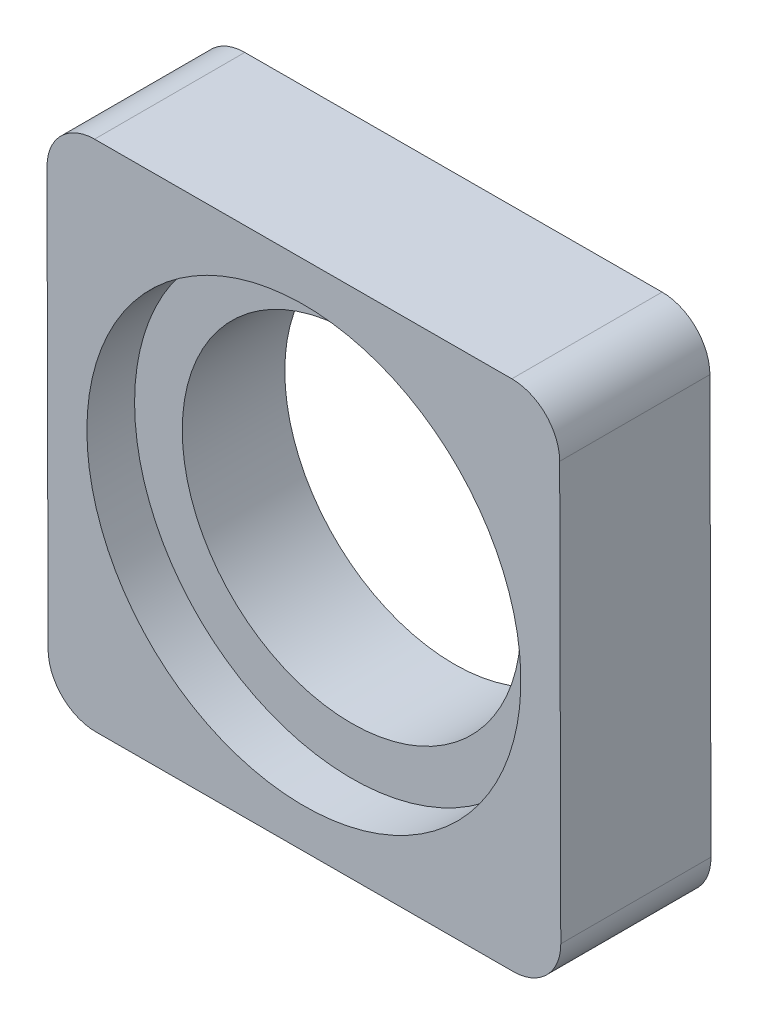
ISO-10303-21;
HEADER;
FILE_DESCRIPTION(('STEP AP214'),'2;1');
FILE_NAME('part.step','',(''),(''),'','','');
FILE_SCHEMA(('AUTOMOTIVE_DESIGN { 1 0 10303 214 1 1 1 1 }'));
ENDSEC;
DATA;
#1=APPLICATION_CONTEXT('core data for automotive mechanical design processes');
#2=APPLICATION_PROTOCOL_DEFINITION('international standard','automotive_design',2000,#1);
#3=PRODUCT_CONTEXT('',#1,'mechanical');
#4=PRODUCT('Part','Part','',(#3));
#5=PRODUCT_RELATED_PRODUCT_CATEGORY('part','',(#4));
#6=PRODUCT_DEFINITION_FORMATION('','',#4);
#7=PRODUCT_DEFINITION_CONTEXT('part definition',#1,'design');
#8=PRODUCT_DEFINITION('design','',#6,#7);
#9=PRODUCT_DEFINITION_SHAPE('','',#8);
#10=(LENGTH_UNIT() NAMED_UNIT(*) SI_UNIT(.MILLI.,.METRE.));
#11=(NAMED_UNIT(*) PLANE_ANGLE_UNIT() SI_UNIT($,.RADIAN.));
#12=(NAMED_UNIT(*) SI_UNIT($,.STERADIAN.) SOLID_ANGLE_UNIT());
#13=UNCERTAINTY_MEASURE_WITH_UNIT(LENGTH_MEASURE(1.E-05),#10,'distance_accuracy_value','');
#14=(GEOMETRIC_REPRESENTATION_CONTEXT(3) GLOBAL_UNCERTAINTY_ASSIGNED_CONTEXT((#13)) GLOBAL_UNIT_ASSIGNED_CONTEXT((#10,
#11,#12)) REPRESENTATION_CONTEXT('',''));
#15=CARTESIAN_POINT('',(0.,0.,0.));
#16=DIRECTION('',(0.,0.,1.));
#17=DIRECTION('',(1.,0.,0.));
#18=AXIS2_PLACEMENT_3D('',#15,#16,#17);
#19=CARTESIAN_POINT('',(0.0190924915619453,-7.19585327856389,6.3));
#20=DIRECTION('',(0.,0.,-1.));
#21=DIRECTION('',(-1.,0.,0.));
#22=AXIS2_PLACEMENT_3D('',#19,#20,#21);
#23=CYLINDRICAL_SURFACE('',#22,9.1);
#24=CARTESIAN_POINT('',(0.0190924915619453,-7.19585327856389,4.3));
#25=DIRECTION('',(0.,0.,-1.));
#26=DIRECTION('',(-1.,0.,0.));
#27=AXIS2_PLACEMENT_3D('',#24,#25,#26);
#28=CIRCLE('',#27,9.1);
#29=CARTESIAN_POINT('',(-9.08090750843805,-7.19585327856389,4.3));
#30=VERTEX_POINT('',#29);
#31=EDGE_CURVE('E21',#30,#30,#28,.T.);
#32=ORIENTED_EDGE('',*,*,#31,.T.);
#33=EDGE_LOOP('',(#32));
#34=FACE_BOUND('',#33,.T.);
#35=CARTESIAN_POINT('',(0.0190924915619453,-7.19585327856389,6.3));
#36=DIRECTION('',(0.,0.,-1.));
#37=DIRECTION('',(-1.,0.,0.));
#38=AXIS2_PLACEMENT_3D('',#35,#36,#37);
#39=CIRCLE('',#38,9.1);
#40=CARTESIAN_POINT('',(-9.08090750843805,-7.19585327856389,6.3));
#41=VERTEX_POINT('',#40);
#42=EDGE_CURVE('E141',#41,#41,#39,.T.);
#43=ORIENTED_EDGE('',*,*,#42,.F.);
#44=EDGE_LOOP('',(#43));
#45=FACE_BOUND('',#44,.T.);
#46=ADVANCED_FACE('F17',(#34,#45),#23,.F.);
#47=CARTESIAN_POINT('',(0.0190924915619453,-7.19585327856389,4.3));
#48=DIRECTION('',(0.,0.,-1.));
#49=DIRECTION('',(-1.,0.,0.));
#50=AXIS2_PLACEMENT_3D('',#47,#48,#49);
#51=PLANE('',#50);
#52=ORIENTED_EDGE('',*,*,#31,.F.);
#53=EDGE_LOOP('',(#52));
#54=FACE_BOUND('',#53,.T.);
#55=CARTESIAN_POINT('',(0.0190924915619453,-7.19585327856389,4.3));
#56=DIRECTION('',(0.,0.,1.));
#57=DIRECTION('',(1.,0.,0.));
#58=AXIS2_PLACEMENT_3D('',#55,#56,#57);
#59=CIRCLE('',#58,7.1);
#60=CARTESIAN_POINT('',(7.11909249156195,-7.19585327856389,4.3));
#61=VERTEX_POINT('',#60);
#62=EDGE_CURVE('E103',#61,#61,#59,.F.);
#63=ORIENTED_EDGE('',*,*,#62,.T.);
#64=EDGE_LOOP('',(#63));
#65=FACE_BOUND('',#64,.T.);
#66=ADVANCED_FACE('F150',(#54,#65),#51,.F.);
#67=CARTESIAN_POINT('',(0.0190924915619461,-7.19585327856389,6.3));
#68=DIRECTION('',(0.,0.,1.));
#69=DIRECTION('',(1.,0.,0.));
#70=AXIS2_PLACEMENT_3D('',#67,#68,#69);
#71=PLANE('',#70);
#72=ORIENTED_EDGE('',*,*,#42,.T.);
#73=EDGE_LOOP('',(#72));
#74=FACE_BOUND('',#73,.T.);
#75=CARTESIAN_POINT('',(8.79227766248115,-15.9226065096782,6.3));
#76=DIRECTION('',(0.,0.,1.));
#77=DIRECTION('',(1.,0.,0.));
#78=AXIS2_PLACEMENT_3D('',#75,#76,#77);
#79=CIRCLE('',#78,2.);
#80=CARTESIAN_POINT('',(10.7922706227135,-15.9173000022719,6.3));
#81=VERTEX_POINT('',#80);
#82=CARTESIAN_POINT('',(8.79758416988742,-17.9225994699106,6.3));
#83=VERTEX_POINT('',#82);
#84=EDGE_CURVE('E136',#81,#83,#79,.F.);
#85=ORIENTED_EDGE('',*,*,#84,.F.);
#86=DIRECTION('',(-0.00265325370313881,0.999996480116199,0.));
#87=VECTOR('',#86,1.);
#88=CARTESIAN_POINT('',(10.7577783245727,-2.9173457607613,6.3));
#89=LINE('',#88,#87);
#90=CARTESIAN_POINT('',(10.7458386829086,1.58263839976159,6.3));
#91=VERTEX_POINT('',#90);
#92=EDGE_CURVE('E113',#91,#81,#89,.F.);
#93=ORIENTED_EDGE('',*,*,#92,.F.);
#94=CARTESIAN_POINT('',(8.74584572267622,1.57733189235532,6.3));
#95=DIRECTION('',(0.,0.,1.));
#96=DIRECTION('',(1.,0.,0.));
#97=AXIS2_PLACEMENT_3D('',#94,#95,#96);
#98=CIRCLE('',#97,2.);
#99=CARTESIAN_POINT('',(8.74053921526994,3.57732485258771,6.3));
#100=VERTEX_POINT('',#99);
#101=EDGE_CURVE('E99',#100,#91,#98,.F.);
#102=ORIENTED_EDGE('',*,*,#101,.F.);
#103=DIRECTION('',(-0.999996480116199,-0.0026532537031389,0.));
#104=VECTOR('',#103,1.);
#105=CARTESIAN_POINT('',(-10.7593921469959,3.52558640537651,6.3));
#106=LINE('',#105,#104);
#107=CARTESIAN_POINT('',(-8.75939918676353,3.53089291278278,6.3));
#108=VERTEX_POINT('',#107);
#109=EDGE_CURVE('E93',#108,#100,#106,.F.);
#110=ORIENTED_EDGE('',*,*,#109,.F.);
#111=CARTESIAN_POINT('',(-8.75409267935725,1.53089995255039,6.3));
#112=DIRECTION('',(0.,0.,1.));
#113=DIRECTION('',(1.,0.,0.));
#114=AXIS2_PLACEMENT_3D('',#111,#112,#113);
#115=CIRCLE('',#114,2.);
#116=CARTESIAN_POINT('',(-10.7540856395897,1.52559344514411,6.3));
#117=VERTEX_POINT('',#116);
#118=EDGE_CURVE('E84',#117,#108,#115,.F.);
#119=ORIENTED_EDGE('',*,*,#118,.F.);
#120=DIRECTION('',(0.00265325370313882,-0.999996480116199,0.));
#121=VECTOR('',#120,1.);
#122=CARTESIAN_POINT('',(-10.7421459979255,-2.97439071537878,6.3));
#123=LINE('',#122,#121);
#124=CARTESIAN_POINT('',(-10.7076536997847,-15.9743449568894,6.3));
#125=VERTEX_POINT('',#124);
#126=EDGE_CURVE('E79',#125,#117,#123,.F.);
#127=ORIENTED_EDGE('',*,*,#126,.F.);
#128=CARTESIAN_POINT('',(-8.70766073955233,-15.9690384494831,6.3));
#129=DIRECTION('',(0.,0.,1.));
#130=DIRECTION('',(1.,0.,0.));
#131=AXIS2_PLACEMENT_3D('',#128,#129,#130);
#132=CIRCLE('',#131,2.);
#133=CARTESIAN_POINT('',(-8.70235423214605,-17.9690314097155,6.3));
#134=VERTEX_POINT('',#133);
#135=EDGE_CURVE('E138',#134,#125,#132,.F.);
#136=ORIENTED_EDGE('',*,*,#135,.F.);
#137=DIRECTION('',(0.999996480116199,0.00265325370313912,0.));
#138=VECTOR('',#137,1.);
#139=CARTESIAN_POINT('',(0.0476149688706887,-17.945815439813,6.3));
#140=LINE('',#139,#138);
#141=EDGE_CURVE('E117',#83,#134,#140,.F.);
#142=ORIENTED_EDGE('',*,*,#141,.F.);
#143=EDGE_LOOP('',(#85,#93,#102,#110,#119,#127,#136,#142));
#144=FACE_BOUND('',#143,.T.);
#145=ADVANCED_FACE('F97',(#74,#144),#71,.T.);
#146=CARTESIAN_POINT('',(0.0190924915619453,-7.19585327856389,31.1303043484805));
#147=DIRECTION('',(0.,0.,1.));
#148=DIRECTION('',(1.,0.,0.));
#149=AXIS2_PLACEMENT_3D('',#146,#147,#148);
#150=CYLINDRICAL_SURFACE('',#149,7.1);
#151=ORIENTED_EDGE('',*,*,#62,.F.);
#152=EDGE_LOOP('',(#151));
#153=FACE_BOUND('',#152,.T.);
#154=CARTESIAN_POINT('',(0.0190924915619453,-7.19585327856389,0.));
#155=DIRECTION('',(0.,0.,1.));
#156=DIRECTION('',(1.,0.,0.));
#157=AXIS2_PLACEMENT_3D('',#154,#155,#156);
#158=CIRCLE('',#157,7.1);
#159=CARTESIAN_POINT('',(7.11909249156195,-7.19585327856389,0.));
#160=VERTEX_POINT('',#159);
#161=EDGE_CURVE('E131',#160,#160,#158,.F.);
#162=ORIENTED_EDGE('',*,*,#161,.T.);
#163=EDGE_LOOP('',(#162));
#164=FACE_BOUND('',#163,.T.);
#165=ADVANCED_FACE('F156',(#153,#164),#150,.F.);
#166=CARTESIAN_POINT('',(-10.7593921469959,3.52558640537651,0.));
#167=DIRECTION('',(-0.0026532537031389,0.999996480116199,0.));
#168=DIRECTION('',(-0.999996480116199,-0.0026532537031389,0.));
#169=AXIS2_PLACEMENT_3D('',#166,#167,#168);
#170=PLANE('',#169);
#171=DIRECTION('',(0.,0.,1.));
#172=VECTOR('',#171,1.);
#173=CARTESIAN_POINT('',(-8.75939918676353,3.53089291278278,0.));
#174=LINE('',#173,#172);
#175=CARTESIAN_POINT('',(-8.75939918676353,3.53089291278278,0.));
#176=VERTEX_POINT('',#175);
#177=EDGE_CURVE('E89',#108,#176,#174,.F.);
#178=ORIENTED_EDGE('',*,*,#177,.F.);
#179=ORIENTED_EDGE('',*,*,#109,.T.);
#180=DIRECTION('',(0.,0.,1.));
#181=VECTOR('',#180,1.);
#182=CARTESIAN_POINT('',(8.74053921526994,3.57732485258771,0.));
#183=LINE('',#182,#181);
#184=CARTESIAN_POINT('',(8.74053921526994,3.57732485258771,0.));
#185=VERTEX_POINT('',#184);
#186=EDGE_CURVE('E134',#185,#100,#183,.T.);
#187=ORIENTED_EDGE('',*,*,#186,.F.);
#188=DIRECTION('',(-0.999996480116198,-0.00265325370313893,0.));
#189=VECTOR('',#188,1.);
#190=CARTESIAN_POINT('',(8.74053921526994,3.57732485258771,0.));
#191=LINE('',#190,#189);
#192=EDGE_CURVE('E107',#185,#176,#191,.T.);
#193=ORIENTED_EDGE('',*,*,#192,.T.);
#194=EDGE_LOOP('',(#178,#179,#187,#193));
#195=FACE_BOUND('',#194,.T.);
#196=ADVANCED_FACE('F106',(#195),#170,.T.);
#197=CARTESIAN_POINT('',(-8.75409267935725,1.53089995255039,0.));
#198=DIRECTION('',(0.,0.,1.));
#199=DIRECTION('',(1.,0.,0.));
#200=AXIS2_PLACEMENT_3D('',#197,#198,#199);
#201=CYLINDRICAL_SURFACE('',#200,2.);
#202=CARTESIAN_POINT('',(-8.75409267935725,1.53089995255039,0.));
#203=DIRECTION('',(0.,0.,1.));
#204=DIRECTION('',(1.,0.,0.));
#205=AXIS2_PLACEMENT_3D('',#202,#203,#204);
#206=CIRCLE('',#205,2.);
#207=CARTESIAN_POINT('',(-10.7540856395897,1.52559344514411,0.));
#208=VERTEX_POINT('',#207);
#209=EDGE_CURVE('E129',#176,#208,#206,.T.);
#210=ORIENTED_EDGE('',*,*,#209,.T.);
#211=DIRECTION('',(0.,0.,1.));
#212=VECTOR('',#211,1.);
#213=CARTESIAN_POINT('',(-10.7540856395897,1.52559344514411,0.));
#214=LINE('',#213,#212);
#215=EDGE_CURVE('E91',#117,#208,#214,.F.);
#216=ORIENTED_EDGE('',*,*,#215,.F.);
#217=ORIENTED_EDGE('',*,*,#118,.T.);
#218=ORIENTED_EDGE('',*,*,#177,.T.);
#219=EDGE_LOOP('',(#210,#216,#217,#218));
#220=FACE_BOUND('',#219,.T.);
#221=ADVANCED_FACE('F87',(#220),#201,.T.);
#222=CARTESIAN_POINT('',(-10.7421459979255,-2.97439071537878,0.));
#223=DIRECTION('',(-0.999996480116199,-0.00265325370313882,0.));
#224=DIRECTION('',(0.00265325370313882,-0.999996480116199,0.));
#225=AXIS2_PLACEMENT_3D('',#222,#223,#224);
#226=PLANE('',#225);
#227=ORIENTED_EDGE('',*,*,#215,.T.);
#228=DIRECTION('',(0.00265325370313874,-0.999996480116198,0.));
#229=VECTOR('',#228,1.);
#230=CARTESIAN_POINT('',(-10.7540856395897,1.52559344514411,0.));
#231=LINE('',#230,#229);
#232=CARTESIAN_POINT('',(-10.7076536997847,-15.9743449568894,0.));
#233=VERTEX_POINT('',#232);
#234=EDGE_CURVE('E128',#208,#233,#231,.T.);
#235=ORIENTED_EDGE('',*,*,#234,.T.);
#236=DIRECTION('',(0.,0.,1.));
#237=VECTOR('',#236,1.);
#238=CARTESIAN_POINT('',(-10.7076536997847,-15.9743449568894,0.));
#239=LINE('',#238,#237);
#240=EDGE_CURVE('E119',#125,#233,#239,.F.);
#241=ORIENTED_EDGE('',*,*,#240,.F.);
#242=ORIENTED_EDGE('',*,*,#126,.T.);
#243=EDGE_LOOP('',(#227,#235,#241,#242));
#244=FACE_BOUND('',#243,.T.);
#245=ADVANCED_FACE('F195',(#244),#226,.T.);
#246=CARTESIAN_POINT('',(-8.70766073955233,-15.9690384494831,0.));
#247=DIRECTION('',(0.,0.,1.));
#248=DIRECTION('',(1.,0.,0.));
#249=AXIS2_PLACEMENT_3D('',#246,#247,#248);
#250=CYLINDRICAL_SURFACE('',#249,2.);
#251=CARTESIAN_POINT('',(-8.70766073955233,-15.9690384494831,0.));
#252=DIRECTION('',(0.,0.,1.));
#253=DIRECTION('',(1.,0.,0.));
#254=AXIS2_PLACEMENT_3D('',#251,#252,#253);
#255=CIRCLE('',#254,2.);
#256=CARTESIAN_POINT('',(-8.70235423214605,-17.9690314097155,0.));
#257=VERTEX_POINT('',#256);
#258=EDGE_CURVE('E125',#233,#257,#255,.T.);
#259=ORIENTED_EDGE('',*,*,#258,.T.);
#260=DIRECTION('',(0.,0.,1.));
#261=VECTOR('',#260,1.);
#262=CARTESIAN_POINT('',(-8.70235423214605,-17.9690314097155,0.));
#263=LINE('',#262,#261);
#264=EDGE_CURVE('E118',#134,#257,#263,.F.);
#265=ORIENTED_EDGE('',*,*,#264,.F.);
#266=ORIENTED_EDGE('',*,*,#135,.T.);
#267=ORIENTED_EDGE('',*,*,#240,.T.);
#268=EDGE_LOOP('',(#259,#265,#266,#267));
#269=FACE_BOUND('',#268,.T.);
#270=ADVANCED_FACE('F190',(#269),#250,.T.);
#271=CARTESIAN_POINT('',(0.0476149688706887,-17.945815439813,0.));
#272=DIRECTION('',(0.00265325370313912,-0.999996480116199,0.));
#273=DIRECTION('',(0.999996480116199,0.00265325370313912,0.));
#274=AXIS2_PLACEMENT_3D('',#271,#272,#273);
#275=PLANE('',#274);
#276=ORIENTED_EDGE('',*,*,#264,.T.);
#277=DIRECTION('',(0.999996480116198,0.00265325370313894,0.));
#278=VECTOR('',#277,1.);
#279=CARTESIAN_POINT('',(-8.70235423214605,-17.9690314097155,0.));
#280=LINE('',#279,#278);
#281=CARTESIAN_POINT('',(8.79758416988742,-17.9225994699106,0.));
#282=VERTEX_POINT('',#281);
#283=EDGE_CURVE('E124',#257,#282,#280,.T.);
#284=ORIENTED_EDGE('',*,*,#283,.T.);
#285=DIRECTION('',(0.,0.,1.));
#286=VECTOR('',#285,1.);
#287=CARTESIAN_POINT('',(8.79758416988742,-17.9225994699105,0.));
#288=LINE('',#287,#286);
#289=EDGE_CURVE('E116',#83,#282,#288,.F.);
#290=ORIENTED_EDGE('',*,*,#289,.F.);
#291=ORIENTED_EDGE('',*,*,#141,.T.);
#292=EDGE_LOOP('',(#276,#284,#290,#291));
#293=FACE_BOUND('',#292,.T.);
#294=ADVANCED_FACE('F206',(#293),#275,.T.);
#295=CARTESIAN_POINT('',(8.79227766248115,-15.9226065096782,0.));
#296=DIRECTION('',(0.,0.,1.));
#297=DIRECTION('',(1.,0.,0.));
#298=AXIS2_PLACEMENT_3D('',#295,#296,#297);
#299=CYLINDRICAL_SURFACE('',#298,2.);
#300=CARTESIAN_POINT('',(8.79227766248115,-15.9226065096782,0.));
#301=DIRECTION('',(0.,0.,1.));
#302=DIRECTION('',(1.,0.,0.));
#303=AXIS2_PLACEMENT_3D('',#300,#301,#302);
#304=CIRCLE('',#303,2.);
#305=CARTESIAN_POINT('',(10.7922706227135,-15.9173000022719,0.));
#306=VERTEX_POINT('',#305);
#307=EDGE_CURVE('E121',#282,#306,#304,.T.);
#308=ORIENTED_EDGE('',*,*,#307,.T.);
#309=DIRECTION('',(0.,0.,1.));
#310=VECTOR('',#309,1.);
#311=CARTESIAN_POINT('',(10.7922706227135,-15.9173000022719,0.));
#312=LINE('',#311,#310);
#313=EDGE_CURVE('E115',#81,#306,#312,.F.);
#314=ORIENTED_EDGE('',*,*,#313,.F.);
#315=ORIENTED_EDGE('',*,*,#84,.T.);
#316=ORIENTED_EDGE('',*,*,#289,.T.);
#317=EDGE_LOOP('',(#308,#314,#315,#316));
#318=FACE_BOUND('',#317,.T.);
#319=ADVANCED_FACE('F180',(#318),#299,.T.);
#320=CARTESIAN_POINT('',(10.7577783245727,-2.9173457607613,0.));
#321=DIRECTION('',(0.999996480116199,0.00265325370313881,0.));
#322=DIRECTION('',(-0.00265325370313881,0.999996480116199,0.));
#323=AXIS2_PLACEMENT_3D('',#320,#321,#322);
#324=PLANE('',#323);
#325=ORIENTED_EDGE('',*,*,#313,.T.);
#326=DIRECTION('',(-0.00265325370313884,0.999996480116198,0.));
#327=VECTOR('',#326,1.);
#328=CARTESIAN_POINT('',(10.7922706227135,-15.9173000022719,0.));
#329=LINE('',#328,#327);
#330=CARTESIAN_POINT('',(10.7458386829086,1.58263839976159,0.));
#331=VERTEX_POINT('',#330);
#332=EDGE_CURVE('E27',#306,#331,#329,.T.);
#333=ORIENTED_EDGE('',*,*,#332,.T.);
#334=DIRECTION('',(0.,0.,1.));
#335=VECTOR('',#334,1.);
#336=CARTESIAN_POINT('',(10.7458386829086,1.58263839976159,0.));
#337=LINE('',#336,#335);
#338=EDGE_CURVE('E35',#91,#331,#337,.F.);
#339=ORIENTED_EDGE('',*,*,#338,.F.);
#340=ORIENTED_EDGE('',*,*,#92,.T.);
#341=EDGE_LOOP('',(#325,#333,#339,#340));
#342=FACE_BOUND('',#341,.T.);
#343=ADVANCED_FACE('F170',(#342),#324,.T.);
#344=CARTESIAN_POINT('',(8.74584572267622,1.57733189235532,0.));
#345=DIRECTION('',(0.,0.,1.));
#346=DIRECTION('',(1.,0.,0.));
#347=AXIS2_PLACEMENT_3D('',#344,#345,#346);
#348=CYLINDRICAL_SURFACE('',#347,2.);
#349=CARTESIAN_POINT('',(8.74584572267622,1.57733189235532,0.));
#350=DIRECTION('',(0.,0.,1.));
#351=DIRECTION('',(1.,0.,0.));
#352=AXIS2_PLACEMENT_3D('',#349,#350,#351);
#353=CIRCLE('',#352,2.);
#354=EDGE_CURVE('E11',#331,#185,#353,.T.);
#355=ORIENTED_EDGE('',*,*,#354,.T.);
#356=ORIENTED_EDGE('',*,*,#186,.T.);
#357=ORIENTED_EDGE('',*,*,#101,.T.);
#358=ORIENTED_EDGE('',*,*,#338,.T.);
#359=EDGE_LOOP('',(#355,#356,#357,#358));
#360=FACE_BOUND('',#359,.T.);
#361=ADVANCED_FACE('F163',(#360),#348,.T.);
#362=CARTESIAN_POINT('',(0.0190924915619461,-7.19585327856389,0.));
#363=DIRECTION('',(0.,0.,1.));
#364=DIRECTION('',(1.,0.,0.));
#365=AXIS2_PLACEMENT_3D('',#362,#363,#364);
#366=PLANE('',#365);
#367=ORIENTED_EDGE('',*,*,#332,.F.);
#368=ORIENTED_EDGE('',*,*,#307,.F.);
#369=ORIENTED_EDGE('',*,*,#283,.F.);
#370=ORIENTED_EDGE('',*,*,#258,.F.);
#371=ORIENTED_EDGE('',*,*,#234,.F.);
#372=ORIENTED_EDGE('',*,*,#209,.F.);
#373=ORIENTED_EDGE('',*,*,#192,.F.);
#374=ORIENTED_EDGE('',*,*,#354,.F.);
#375=EDGE_LOOP('',(#367,#368,#369,#370,#371,#372,#373,#374));
#376=FACE_BOUND('',#375,.T.);
#377=ORIENTED_EDGE('',*,*,#161,.F.);
#378=EDGE_LOOP('',(#377));
#379=FACE_BOUND('',#378,.T.);
#380=ADVANCED_FACE('F19',(#376,#379),#366,.F.);
#381=CLOSED_SHELL('',(#46,#66,#145,#165,#196,#221,#245,#270,#294,#319,#343,#361,#380));
#382=MANIFOLD_SOLID_BREP('B1',#381);
#383=ADVANCED_BREP_SHAPE_REPRESENTATION('',(#18,#382),#14);
#384=SHAPE_DEFINITION_REPRESENTATION(#9,#383);
ENDSEC;
END-ISO-10303-21;
